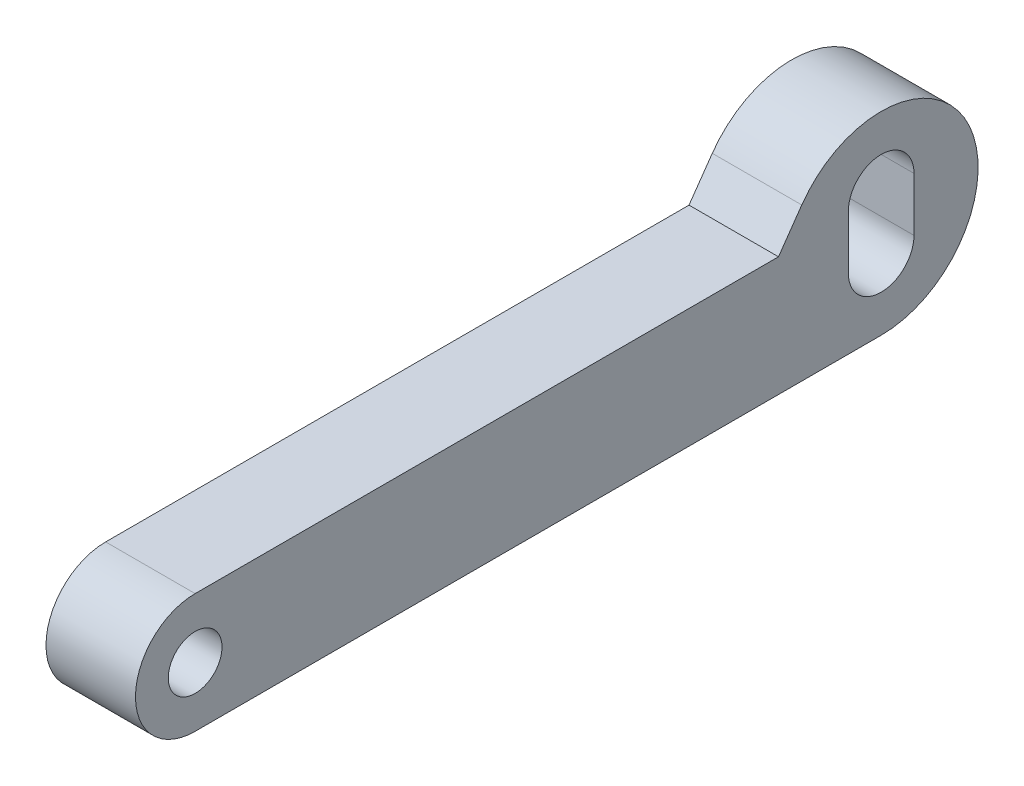
ISO-10303-21;
HEADER;
FILE_DESCRIPTION(('STEP AP214'),'2;1');
FILE_NAME('part.step','',(''),(''),'','','');
FILE_SCHEMA(('AUTOMOTIVE_DESIGN { 1 0 10303 214 1 1 1 1 }'));
ENDSEC;
DATA;
#1=APPLICATION_CONTEXT('core data for automotive mechanical design processes');
#2=APPLICATION_PROTOCOL_DEFINITION('international standard','automotive_design',2000,#1);
#3=PRODUCT_CONTEXT('',#1,'mechanical');
#4=PRODUCT('Part','Part','',(#3));
#5=PRODUCT_RELATED_PRODUCT_CATEGORY('part','',(#4));
#6=PRODUCT_DEFINITION_FORMATION('','',#4);
#7=PRODUCT_DEFINITION_CONTEXT('part definition',#1,'design');
#8=PRODUCT_DEFINITION('design','',#6,#7);
#9=PRODUCT_DEFINITION_SHAPE('','',#8);
#10=(LENGTH_UNIT() NAMED_UNIT(*) SI_UNIT(.MILLI.,.METRE.));
#11=(NAMED_UNIT(*) PLANE_ANGLE_UNIT() SI_UNIT($,.RADIAN.));
#12=(NAMED_UNIT(*) SI_UNIT($,.STERADIAN.) SOLID_ANGLE_UNIT());
#13=UNCERTAINTY_MEASURE_WITH_UNIT(LENGTH_MEASURE(1.E-05),#10,'distance_accuracy_value','');
#14=(GEOMETRIC_REPRESENTATION_CONTEXT(3) GLOBAL_UNCERTAINTY_ASSIGNED_CONTEXT((#13)) GLOBAL_UNIT_ASSIGNED_CONTEXT((#10,
#11,#12)) REPRESENTATION_CONTEXT('',''));
#15=CARTESIAN_POINT('',(0.,0.,0.));
#16=DIRECTION('',(0.,0.,1.));
#17=DIRECTION('',(1.,0.,0.));
#18=AXIS2_PLACEMENT_3D('',#15,#16,#17);
#19=CARTESIAN_POINT('',(3.,2.,0.));
#20=DIRECTION('',(1.,0.,0.));
#21=DIRECTION('',(0.,0.,-1.));
#22=AXIS2_PLACEMENT_3D('',#19,#20,#21);
#23=PLANE('',#22);
#24=DIRECTION('',(0.,-1.,0.));
#25=VECTOR('',#24,1.);
#26=CARTESIAN_POINT('',(3.,4.15000000000002,-21.9));
#27=LINE('',#26,#25);
#28=CARTESIAN_POINT('',(3.,4.15000000000002,-21.9));
#29=VERTEX_POINT('',#28);
#30=CARTESIAN_POINT('',(3.,2.34999999999999,-21.9));
#31=VERTEX_POINT('',#30);
#32=EDGE_CURVE('E113',#29,#31,#27,.T.);
#33=ORIENTED_EDGE('',*,*,#32,.F.);
#34=CARTESIAN_POINT('',(3.,4.15000000000001,-23.));
#35=DIRECTION('',(1.,0.,0.));
#36=DIRECTION('',(0.,0.,-1.));
#37=AXIS2_PLACEMENT_3D('',#34,#35,#36);
#38=CIRCLE('',#37,1.1);
#39=CARTESIAN_POINT('',(3.,4.14999999999999,-24.1));
#40=VERTEX_POINT('',#39);
#41=EDGE_CURVE('E105',#40,#29,#38,.T.);
#42=ORIENTED_EDGE('',*,*,#41,.F.);
#43=DIRECTION('',(0.,1.,0.));
#44=VECTOR('',#43,1.);
#45=CARTESIAN_POINT('',(3.,4.14999999999999,-24.1));
#46=LINE('',#45,#44);
#47=CARTESIAN_POINT('',(3.,2.35000000000001,-24.1));
#48=VERTEX_POINT('',#47);
#49=EDGE_CURVE('E128',#48,#40,#46,.T.);
#50=ORIENTED_EDGE('',*,*,#49,.F.);
#51=CARTESIAN_POINT('',(3.,2.35,-23.));
#52=DIRECTION('',(1.,0.,0.));
#53=DIRECTION('',(0.,0.,-1.));
#54=AXIS2_PLACEMENT_3D('',#51,#52,#53);
#55=CIRCLE('',#54,1.1);
#56=EDGE_CURVE('E126',#31,#48,#55,.T.);
#57=ORIENTED_EDGE('',*,*,#56,.F.);
#58=EDGE_LOOP('',(#33,#42,#50,#57));
#59=FACE_BOUND('',#58,.T.);
#60=CARTESIAN_POINT('',(3.,2.,0.));
#61=DIRECTION('',(1.,0.,0.));
#62=DIRECTION('',(0.,0.,-1.));
#63=AXIS2_PLACEMENT_3D('',#60,#61,#62);
#64=CIRCLE('',#63,2.);
#65=CARTESIAN_POINT('',(3.,4.,0.));
#66=VERTEX_POINT('',#65);
#67=CARTESIAN_POINT('',(3.,0.,0.));
#68=VERTEX_POINT('',#67);
#69=EDGE_CURVE('E144',#66,#68,#64,.T.);
#70=ORIENTED_EDGE('',*,*,#69,.T.);
#71=DIRECTION('',(0.,0.,-1.));
#72=VECTOR('',#71,1.);
#73=CARTESIAN_POINT('',(3.,0.,0.));
#74=LINE('',#73,#72);
#75=CARTESIAN_POINT('',(3.,0.,-23.));
#76=VERTEX_POINT('',#75);
#77=EDGE_CURVE('E147',#68,#76,#74,.T.);
#78=ORIENTED_EDGE('',*,*,#77,.T.);
#79=CARTESIAN_POINT('',(3.,3.25,-23.));
#80=DIRECTION('',(1.,0.,0.));
#81=DIRECTION('',(0.,0.,-1.));
#82=AXIS2_PLACEMENT_3D('',#79,#80,#81);
#83=CIRCLE('',#82,3.25);
#84=CARTESIAN_POINT('',(3.,5.1141234181409,-20.3377558560608));
#85=VERTEX_POINT('',#84);
#86=EDGE_CURVE('E150',#76,#85,#83,.T.);
#87=ORIENTED_EDGE('',*,*,#86,.T.);
#88=DIRECTION('',(0.,-0.819152044288994,0.573576436351043));
#89=VECTOR('',#88,1.);
#90=CARTESIAN_POINT('',(3.,4.,-19.5576382401825));
#91=LINE('',#90,#89);
#92=CARTESIAN_POINT('',(3.,4.,-19.5576382401825));
#93=VERTEX_POINT('',#92);
#94=EDGE_CURVE('E152',#85,#93,#91,.T.);
#95=ORIENTED_EDGE('',*,*,#94,.T.);
#96=DIRECTION('',(0.,0.,1.));
#97=VECTOR('',#96,1.);
#98=CARTESIAN_POINT('',(3.,4.,0.));
#99=LINE('',#98,#97);
#100=EDGE_CURVE('E154',#93,#66,#99,.T.);
#101=ORIENTED_EDGE('',*,*,#100,.T.);
#102=EDGE_LOOP('',(#70,#78,#87,#95,#101));
#103=FACE_BOUND('',#102,.T.);
#104=CARTESIAN_POINT('',(3.,2.,0.));
#105=DIRECTION('',(1.,0.,0.));
#106=DIRECTION('',(0.,0.,-1.));
#107=AXIS2_PLACEMENT_3D('',#104,#105,#106);
#108=CIRCLE('',#107,0.9);
#109=CARTESIAN_POINT('',(3.,2.,-0.900000000000001));
#110=VERTEX_POINT('',#109);
#111=EDGE_CURVE('E134',#110,#110,#108,.T.);
#112=ORIENTED_EDGE('',*,*,#111,.F.);
#113=EDGE_LOOP('',(#112));
#114=FACE_BOUND('',#113,.T.);
#115=ADVANCED_FACE('F34',(#59,#103,#114),#23,.T.);
#116=CARTESIAN_POINT('',(0.,2.,0.));
#117=DIRECTION('',(1.,0.,0.));
#118=DIRECTION('',(0.,0.,-1.));
#119=AXIS2_PLACEMENT_3D('',#116,#117,#118);
#120=PLANE('',#119);
#121=CARTESIAN_POINT('',(0.,4.15000000000001,-23.));
#122=DIRECTION('',(1.,0.,0.));
#123=DIRECTION('',(0.,0.,-1.));
#124=AXIS2_PLACEMENT_3D('',#121,#122,#123);
#125=CIRCLE('',#124,1.1);
#126=CARTESIAN_POINT('',(0.,4.14999999999999,-24.1));
#127=VERTEX_POINT('',#126);
#128=CARTESIAN_POINT('',(0.,4.15000000000002,-21.9));
#129=VERTEX_POINT('',#128);
#130=EDGE_CURVE('E57',#127,#129,#125,.T.);
#131=ORIENTED_EDGE('',*,*,#130,.T.);
#132=DIRECTION('',(0.,-1.,0.));
#133=VECTOR('',#132,1.);
#134=CARTESIAN_POINT('',(0.,4.15000000000002,-21.9));
#135=LINE('',#134,#133);
#136=CARTESIAN_POINT('',(0.,2.34999999999999,-21.9));
#137=VERTEX_POINT('',#136);
#138=EDGE_CURVE('E120',#129,#137,#135,.T.);
#139=ORIENTED_EDGE('',*,*,#138,.T.);
#140=CARTESIAN_POINT('',(0.,2.35,-23.));
#141=DIRECTION('',(1.,0.,0.));
#142=DIRECTION('',(0.,0.,-1.));
#143=AXIS2_PLACEMENT_3D('',#140,#141,#142);
#144=CIRCLE('',#143,1.1);
#145=CARTESIAN_POINT('',(0.,2.35000000000001,-24.1));
#146=VERTEX_POINT('',#145);
#147=EDGE_CURVE('E136',#137,#146,#144,.T.);
#148=ORIENTED_EDGE('',*,*,#147,.T.);
#149=DIRECTION('',(0.,1.,0.));
#150=VECTOR('',#149,1.);
#151=CARTESIAN_POINT('',(0.,4.14999999999999,-24.1));
#152=LINE('',#151,#150);
#153=EDGE_CURVE('E114',#146,#127,#152,.T.);
#154=ORIENTED_EDGE('',*,*,#153,.T.);
#155=EDGE_LOOP('',(#131,#139,#148,#154));
#156=FACE_BOUND('',#155,.T.);
#157=CARTESIAN_POINT('',(0.,2.,0.));
#158=DIRECTION('',(1.,0.,0.));
#159=DIRECTION('',(0.,0.,-1.));
#160=AXIS2_PLACEMENT_3D('',#157,#158,#159);
#161=CIRCLE('',#160,2.);
#162=CARTESIAN_POINT('',(0.,4.,0.));
#163=VERTEX_POINT('',#162);
#164=CARTESIAN_POINT('',(0.,0.,0.));
#165=VERTEX_POINT('',#164);
#166=EDGE_CURVE('E121',#163,#165,#161,.T.);
#167=ORIENTED_EDGE('',*,*,#166,.F.);
#168=DIRECTION('',(0.,0.,1.));
#169=VECTOR('',#168,1.);
#170=CARTESIAN_POINT('',(0.,4.,0.));
#171=LINE('',#170,#169);
#172=CARTESIAN_POINT('',(0.,4.,-19.5576382401825));
#173=VERTEX_POINT('',#172);
#174=EDGE_CURVE('E148',#173,#163,#171,.T.);
#175=ORIENTED_EDGE('',*,*,#174,.F.);
#176=DIRECTION('',(0.,-0.819152044288994,0.573576436351043));
#177=VECTOR('',#176,1.);
#178=CARTESIAN_POINT('',(0.,4.,-19.5576382401825));
#179=LINE('',#178,#177);
#180=CARTESIAN_POINT('',(0.,5.1141234181409,-20.3377558560608));
#181=VERTEX_POINT('',#180);
#182=EDGE_CURVE('E163',#181,#173,#179,.T.);
#183=ORIENTED_EDGE('',*,*,#182,.F.);
#184=CARTESIAN_POINT('',(0.,3.25,-23.));
#185=DIRECTION('',(1.,0.,0.));
#186=DIRECTION('',(0.,0.,-1.));
#187=AXIS2_PLACEMENT_3D('',#184,#185,#186);
#188=CIRCLE('',#187,3.25);
#189=CARTESIAN_POINT('',(0.,0.,-23.));
#190=VERTEX_POINT('',#189);
#191=EDGE_CURVE('E161',#190,#181,#188,.T.);
#192=ORIENTED_EDGE('',*,*,#191,.F.);
#193=DIRECTION('',(0.,0.,-1.));
#194=VECTOR('',#193,1.);
#195=CARTESIAN_POINT('',(0.,0.,0.));
#196=LINE('',#195,#194);
#197=EDGE_CURVE('E159',#165,#190,#196,.T.);
#198=ORIENTED_EDGE('',*,*,#197,.F.);
#199=EDGE_LOOP('',(#167,#175,#183,#192,#198));
#200=FACE_BOUND('',#199,.T.);
#201=CARTESIAN_POINT('',(0.,2.,0.));
#202=DIRECTION('',(1.,0.,0.));
#203=DIRECTION('',(0.,0.,-1.));
#204=AXIS2_PLACEMENT_3D('',#201,#202,#203);
#205=CIRCLE('',#204,0.9);
#206=CARTESIAN_POINT('',(0.,2.,-0.900000000000001));
#207=VERTEX_POINT('',#206);
#208=EDGE_CURVE('E305',#207,#207,#205,.T.);
#209=ORIENTED_EDGE('',*,*,#208,.T.);
#210=EDGE_LOOP('',(#209));
#211=FACE_BOUND('',#210,.T.);
#212=ADVANCED_FACE('F184',(#156,#200,#211),#120,.F.);
#213=CARTESIAN_POINT('',(3.,2.,0.));
#214=DIRECTION('',(-1.,0.,0.));
#215=DIRECTION('',(0.,0.,1.));
#216=AXIS2_PLACEMENT_3D('',#213,#214,#215);
#217=CYLINDRICAL_SURFACE('',#216,2.);
#218=ORIENTED_EDGE('',*,*,#166,.T.);
#219=DIRECTION('',(-1.,0.,0.));
#220=VECTOR('',#219,1.);
#221=CARTESIAN_POINT('',(3.,0.,0.));
#222=LINE('',#221,#220);
#223=EDGE_CURVE('E11',#68,#165,#222,.T.);
#224=ORIENTED_EDGE('',*,*,#223,.F.);
#225=ORIENTED_EDGE('',*,*,#69,.F.);
#226=DIRECTION('',(-1.,0.,0.));
#227=VECTOR('',#226,1.);
#228=CARTESIAN_POINT('',(3.,4.,0.));
#229=LINE('',#228,#227);
#230=EDGE_CURVE('E156',#66,#163,#229,.T.);
#231=ORIENTED_EDGE('',*,*,#230,.T.);
#232=EDGE_LOOP('',(#218,#224,#225,#231));
#233=FACE_BOUND('',#232,.T.);
#234=ADVANCED_FACE('F36',(#233),#217,.T.);
#235=CARTESIAN_POINT('',(3.,0.,0.));
#236=DIRECTION('',(0.,1.,0.));
#237=DIRECTION('',(0.,0.,1.));
#238=AXIS2_PLACEMENT_3D('',#235,#236,#237);
#239=PLANE('',#238);
#240=ORIENTED_EDGE('',*,*,#197,.T.);
#241=DIRECTION('',(-1.,0.,0.));
#242=VECTOR('',#241,1.);
#243=CARTESIAN_POINT('',(3.,0.,-23.));
#244=LINE('',#243,#242);
#245=EDGE_CURVE('E42',#76,#190,#244,.T.);
#246=ORIENTED_EDGE('',*,*,#245,.F.);
#247=ORIENTED_EDGE('',*,*,#77,.F.);
#248=ORIENTED_EDGE('',*,*,#223,.T.);
#249=EDGE_LOOP('',(#240,#246,#247,#248));
#250=FACE_BOUND('',#249,.T.);
#251=ADVANCED_FACE('F198',(#250),#239,.F.);
#252=CARTESIAN_POINT('',(3.,3.25,-23.));
#253=DIRECTION('',(-1.,0.,0.));
#254=DIRECTION('',(0.,0.,1.));
#255=AXIS2_PLACEMENT_3D('',#252,#253,#254);
#256=CYLINDRICAL_SURFACE('',#255,3.25);
#257=ORIENTED_EDGE('',*,*,#191,.T.);
#258=DIRECTION('',(-1.,0.,0.));
#259=VECTOR('',#258,1.);
#260=CARTESIAN_POINT('',(3.,5.1141234181409,-20.3377558560608));
#261=LINE('',#260,#259);
#262=EDGE_CURVE('E171',#85,#181,#261,.T.);
#263=ORIENTED_EDGE('',*,*,#262,.F.);
#264=ORIENTED_EDGE('',*,*,#86,.F.);
#265=ORIENTED_EDGE('',*,*,#245,.T.);
#266=EDGE_LOOP('',(#257,#263,#264,#265));
#267=FACE_BOUND('',#266,.T.);
#268=ADVANCED_FACE('F178',(#267),#256,.T.);
#269=CARTESIAN_POINT('',(3.,4.,-19.5576382401825));
#270=DIRECTION('',(0.,-0.573576436351043,-0.819152044288994));
#271=DIRECTION('',(0.,0.819152044288994,-0.573576436351043));
#272=AXIS2_PLACEMENT_3D('',#269,#270,#271);
#273=PLANE('',#272);
#274=ORIENTED_EDGE('',*,*,#182,.T.);
#275=DIRECTION('',(-1.,0.,0.));
#276=VECTOR('',#275,1.);
#277=CARTESIAN_POINT('',(3.,4.,-19.5576382401825));
#278=LINE('',#277,#276);
#279=EDGE_CURVE('E168',#93,#173,#278,.T.);
#280=ORIENTED_EDGE('',*,*,#279,.F.);
#281=ORIENTED_EDGE('',*,*,#94,.F.);
#282=ORIENTED_EDGE('',*,*,#262,.T.);
#283=EDGE_LOOP('',(#274,#280,#281,#282));
#284=FACE_BOUND('',#283,.T.);
#285=ADVANCED_FACE('F189',(#284),#273,.F.);
#286=CARTESIAN_POINT('',(3.,4.,0.));
#287=DIRECTION('',(0.,-1.,0.));
#288=DIRECTION('',(0.,0.,-1.));
#289=AXIS2_PLACEMENT_3D('',#286,#287,#288);
#290=PLANE('',#289);
#291=ORIENTED_EDGE('',*,*,#174,.T.);
#292=ORIENTED_EDGE('',*,*,#230,.F.);
#293=ORIENTED_EDGE('',*,*,#100,.F.);
#294=ORIENTED_EDGE('',*,*,#279,.T.);
#295=EDGE_LOOP('',(#291,#292,#293,#294));
#296=FACE_BOUND('',#295,.T.);
#297=ADVANCED_FACE('F193',(#296),#290,.F.);
#298=CARTESIAN_POINT('',(3.,4.15000000000001,-23.));
#299=DIRECTION('',(-1.,0.,0.));
#300=DIRECTION('',(0.,0.,1.));
#301=AXIS2_PLACEMENT_3D('',#298,#299,#300);
#302=CYLINDRICAL_SURFACE('',#301,1.1);
#303=ORIENTED_EDGE('',*,*,#130,.F.);
#304=DIRECTION('',(-1.,0.,0.));
#305=VECTOR('',#304,1.);
#306=CARTESIAN_POINT('',(3.,4.14999999999999,-24.1));
#307=LINE('',#306,#305);
#308=EDGE_CURVE('E109',#40,#127,#307,.T.);
#309=ORIENTED_EDGE('',*,*,#308,.F.);
#310=ORIENTED_EDGE('',*,*,#41,.T.);
#311=DIRECTION('',(-1.,0.,0.));
#312=VECTOR('',#311,1.);
#313=CARTESIAN_POINT('',(3.,4.15000000000002,-21.9));
#314=LINE('',#313,#312);
#315=EDGE_CURVE('E108',#29,#129,#314,.T.);
#316=ORIENTED_EDGE('',*,*,#315,.T.);
#317=EDGE_LOOP('',(#303,#309,#310,#316));
#318=FACE_BOUND('',#317,.T.);
#319=ADVANCED_FACE('F107',(#318),#302,.F.);
#320=CARTESIAN_POINT('',(3.,4.15000000000002,-21.9));
#321=DIRECTION('',(0.,0.,-1.));
#322=DIRECTION('',(-1.,0.,0.));
#323=AXIS2_PLACEMENT_3D('',#320,#321,#322);
#324=PLANE('',#323);
#325=ORIENTED_EDGE('',*,*,#138,.F.);
#326=ORIENTED_EDGE('',*,*,#315,.F.);
#327=ORIENTED_EDGE('',*,*,#32,.T.);
#328=DIRECTION('',(-1.,0.,0.));
#329=VECTOR('',#328,1.);
#330=CARTESIAN_POINT('',(3.,2.34999999999999,-21.9));
#331=LINE('',#330,#329);
#332=EDGE_CURVE('E122',#31,#137,#331,.T.);
#333=ORIENTED_EDGE('',*,*,#332,.T.);
#334=EDGE_LOOP('',(#325,#326,#327,#333));
#335=FACE_BOUND('',#334,.T.);
#336=ADVANCED_FACE('F117',(#335),#324,.T.);
#337=CARTESIAN_POINT('',(3.,2.35,-23.));
#338=DIRECTION('',(-1.,0.,0.));
#339=DIRECTION('',(0.,0.,1.));
#340=AXIS2_PLACEMENT_3D('',#337,#338,#339);
#341=CYLINDRICAL_SURFACE('',#340,1.1);
#342=ORIENTED_EDGE('',*,*,#147,.F.);
#343=ORIENTED_EDGE('',*,*,#332,.F.);
#344=ORIENTED_EDGE('',*,*,#56,.T.);
#345=DIRECTION('',(-1.,0.,0.));
#346=VECTOR('',#345,1.);
#347=CARTESIAN_POINT('',(3.,2.35000000000001,-24.1));
#348=LINE('',#347,#346);
#349=EDGE_CURVE('E49',#48,#146,#348,.T.);
#350=ORIENTED_EDGE('',*,*,#349,.T.);
#351=EDGE_LOOP('',(#342,#343,#344,#350));
#352=FACE_BOUND('',#351,.T.);
#353=ADVANCED_FACE('F242',(#352),#341,.F.);
#354=CARTESIAN_POINT('',(3.,4.14999999999999,-24.1));
#355=DIRECTION('',(0.,0.,1.));
#356=DIRECTION('',(1.,0.,0.));
#357=AXIS2_PLACEMENT_3D('',#354,#355,#356);
#358=PLANE('',#357);
#359=ORIENTED_EDGE('',*,*,#153,.F.);
#360=ORIENTED_EDGE('',*,*,#349,.F.);
#361=ORIENTED_EDGE('',*,*,#49,.T.);
#362=ORIENTED_EDGE('',*,*,#308,.T.);
#363=EDGE_LOOP('',(#359,#360,#361,#362));
#364=FACE_BOUND('',#363,.T.);
#365=ADVANCED_FACE('F248',(#364),#358,.T.);
#366=CARTESIAN_POINT('',(3.,2.,0.));
#367=DIRECTION('',(-1.,0.,0.));
#368=DIRECTION('',(0.,0.,1.));
#369=AXIS2_PLACEMENT_3D('',#366,#367,#368);
#370=CYLINDRICAL_SURFACE('',#369,0.9);
#371=ORIENTED_EDGE('',*,*,#111,.T.);
#372=EDGE_LOOP('',(#371));
#373=FACE_BOUND('',#372,.T.);
#374=ORIENTED_EDGE('',*,*,#208,.F.);
#375=EDGE_LOOP('',(#374));
#376=FACE_BOUND('',#375,.T.);
#377=ADVANCED_FACE('F256',(#373,#376),#370,.F.);
#378=CLOSED_SHELL('',(#115,#212,#234,#251,#268,#285,#297,#319,#336,#353,#365,#377));
#379=MANIFOLD_SOLID_BREP('B2',#378);
#380=ADVANCED_BREP_SHAPE_REPRESENTATION('',(#18,#379),#14);
#381=SHAPE_DEFINITION_REPRESENTATION(#9,#380);
ENDSEC;
END-ISO-10303-21;
